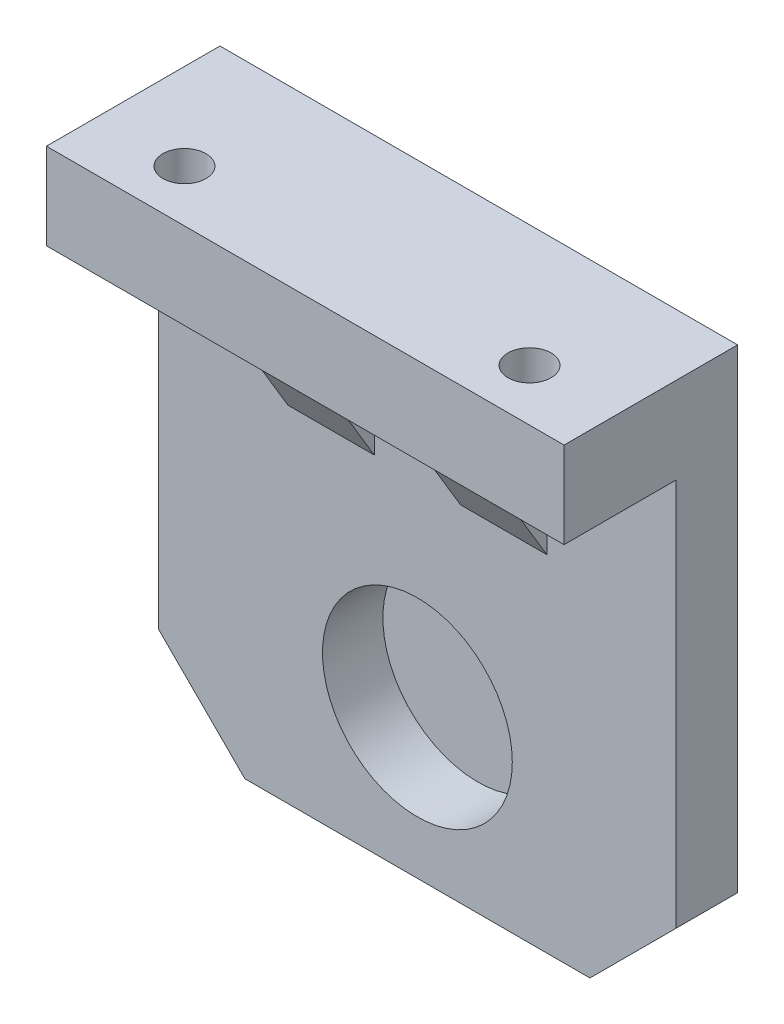
ISO-10303-21;
HEADER;
FILE_DESCRIPTION(('STEP AP214'),'2;1');
FILE_NAME('part.step','',(''),(''),'','','');
FILE_SCHEMA(('AUTOMOTIVE_DESIGN { 1 0 10303 214 1 1 1 1 }'));
ENDSEC;
DATA;
#1=APPLICATION_CONTEXT('core data for automotive mechanical design processes');
#2=APPLICATION_PROTOCOL_DEFINITION('international standard','automotive_design',2000,#1);
#3=PRODUCT_CONTEXT('',#1,'mechanical');
#4=PRODUCT('Part','Part','',(#3));
#5=PRODUCT_RELATED_PRODUCT_CATEGORY('part','',(#4));
#6=PRODUCT_DEFINITION_FORMATION('','',#4);
#7=PRODUCT_DEFINITION_CONTEXT('part definition',#1,'design');
#8=PRODUCT_DEFINITION('design','',#6,#7);
#9=PRODUCT_DEFINITION_SHAPE('','',#8);
#10=(LENGTH_UNIT() NAMED_UNIT(*) SI_UNIT(.MILLI.,.METRE.));
#11=(NAMED_UNIT(*) PLANE_ANGLE_UNIT() SI_UNIT($,.RADIAN.));
#12=(NAMED_UNIT(*) SI_UNIT($,.STERADIAN.) SOLID_ANGLE_UNIT());
#13=UNCERTAINTY_MEASURE_WITH_UNIT(LENGTH_MEASURE(1.E-05),#10,'distance_accuracy_value','');
#14=(GEOMETRIC_REPRESENTATION_CONTEXT(3) GLOBAL_UNCERTAINTY_ASSIGNED_CONTEXT((#13)) GLOBAL_UNIT_ASSIGNED_CONTEXT((#10,
#11,#12)) REPRESENTATION_CONTEXT('',''));
#15=CARTESIAN_POINT('',(0.,0.,0.));
#16=DIRECTION('',(0.,0.,1.));
#17=DIRECTION('',(1.,0.,0.));
#18=AXIS2_PLACEMENT_3D('',#15,#16,#17);
#19=CARTESIAN_POINT('',(29.9999999999989,0.,10.));
#20=DIRECTION('',(1.,0.,0.));
#21=DIRECTION('',(0.,0.,-1.));
#22=AXIS2_PLACEMENT_3D('',#19,#20,#21);
#23=PLANE('',#22);
#24=CARTESIAN_POINT('',(29.9999999999989,15.0999999999986,7.30000000000013));
#25=DIRECTION('',(-1.,0.,0.));
#26=DIRECTION('',(0.,0.,1.));
#27=AXIS2_PLACEMENT_3D('',#24,#25,#26);
#28=CIRCLE('',#27,1.25);
#29=CARTESIAN_POINT('',(29.9999999999989,15.0999999999986,8.55000000000013));
#30=VERTEX_POINT('',#29);
#31=EDGE_CURVE('E343',#30,#30,#28,.T.);
#32=ORIENTED_EDGE('',*,*,#31,.F.);
#33=EDGE_LOOP('',(#32));
#34=FACE_BOUND('',#33,.T.);
#35=CARTESIAN_POINT('',(29.9999999999989,24.5999999999986,7.30000000000014));
#36=DIRECTION('',(-1.,0.,0.));
#37=DIRECTION('',(0.,0.,1.));
#38=AXIS2_PLACEMENT_3D('',#35,#36,#37);
#39=CIRCLE('',#38,1.175);
#40=CARTESIAN_POINT('',(29.9999999999989,24.5999999999986,8.47500000000014));
#41=VERTEX_POINT('',#40);
#42=EDGE_CURVE('E337',#41,#41,#39,.T.);
#43=ORIENTED_EDGE('',*,*,#42,.F.);
#44=EDGE_LOOP('',(#43));
#45=FACE_BOUND('',#44,.T.);
#46=DIRECTION('',(0.,-1.,0.));
#47=VECTOR('',#46,1.);
#48=CARTESIAN_POINT('',(29.9999999999989,0.,2.88675134594813));
#49=LINE('',#48,#47);
#50=CARTESIAN_POINT('',(29.9999999999989,65.,2.88675134594813));
#51=VERTEX_POINT('',#50);
#52=CARTESIAN_POINT('',(29.9999999999989,10.,2.88675134594813));
#53=VERTEX_POINT('',#52);
#54=EDGE_CURVE('E269',#51,#53,#49,.T.);
#55=ORIENTED_EDGE('',*,*,#54,.T.);
#56=DIRECTION('',(0.,0.,1.));
#57=VECTOR('',#56,1.);
#58=CARTESIAN_POINT('',(29.9999999999989,10.,10.));
#59=LINE('',#58,#57);
#60=CARTESIAN_POINT('',(29.9999999999989,10.,10.));
#61=VERTEX_POINT('',#60);
#62=EDGE_CURVE('E11',#53,#61,#59,.T.);
#63=ORIENTED_EDGE('',*,*,#62,.T.);
#64=DIRECTION('',(0.,-1.,0.));
#65=VECTOR('',#64,1.);
#66=CARTESIAN_POINT('',(29.9999999999989,0.,10.));
#67=LINE('',#66,#65);
#68=CARTESIAN_POINT('',(29.9999999999989,55.,10.));
#69=VERTEX_POINT('',#68);
#70=EDGE_CURVE('E241',#69,#61,#67,.T.);
#71=ORIENTED_EDGE('',*,*,#70,.F.);
#72=DIRECTION('',(0.,0.,-1.));
#73=VECTOR('',#72,1.);
#74=CARTESIAN_POINT('',(29.9999999999989,55.,23.));
#75=LINE('',#74,#73);
#76=CARTESIAN_POINT('',(29.9999999999989,55.,23.));
#77=VERTEX_POINT('',#76);
#78=EDGE_CURVE('E233',#77,#69,#75,.T.);
#79=ORIENTED_EDGE('',*,*,#78,.F.);
#80=DIRECTION('',(0.,1.,0.));
#81=VECTOR('',#80,1.);
#82=CARTESIAN_POINT('',(29.9999999999989,65.,23.));
#83=LINE('',#82,#81);
#84=CARTESIAN_POINT('',(29.9999999999989,65.,23.));
#85=VERTEX_POINT('',#84);
#86=EDGE_CURVE('E220',#77,#85,#83,.T.);
#87=ORIENTED_EDGE('',*,*,#86,.T.);
#88=DIRECTION('',(0.,0.,-1.));
#89=VECTOR('',#88,1.);
#90=CARTESIAN_POINT('',(29.9999999999989,65.,10.));
#91=LINE('',#90,#89);
#92=EDGE_CURVE('E249',#85,#51,#91,.T.);
#93=ORIENTED_EDGE('',*,*,#92,.T.);
#94=EDGE_LOOP('',(#55,#63,#71,#79,#87,#93));
#95=FACE_BOUND('',#94,.T.);
#96=ADVANCED_FACE('F33',(#34,#45,#95),#23,.F.);
#97=CARTESIAN_POINT('',(29.9999999999989,0.,10.));
#98=DIRECTION('',(0.,1.,0.));
#99=DIRECTION('',(0.,0.,1.));
#100=AXIS2_PLACEMENT_3D('',#97,#98,#99);
#101=PLANE('',#100);
#102=DIRECTION('',(1.,0.,0.));
#103=VECTOR('',#102,1.);
#104=CARTESIAN_POINT('',(89.9999999999989,0.,2.88675134594813));
#105=LINE('',#104,#103);
#106=CARTESIAN_POINT('',(39.9999999999989,0.,2.88675134594813));
#107=VERTEX_POINT('',#106);
#108=CARTESIAN_POINT('',(79.9999999999988,0.,2.88675134594813));
#109=VERTEX_POINT('',#108);
#110=EDGE_CURVE('E271',#107,#109,#105,.T.);
#111=ORIENTED_EDGE('',*,*,#110,.T.);
#112=DIRECTION('',(0.,0.,1.));
#113=VECTOR('',#112,1.);
#114=CARTESIAN_POINT('',(79.9999999999988,0.,10.));
#115=LINE('',#114,#113);
#116=CARTESIAN_POINT('',(79.9999999999988,0.,10.));
#117=VERTEX_POINT('',#116);
#118=EDGE_CURVE('E290',#109,#117,#115,.T.);
#119=ORIENTED_EDGE('',*,*,#118,.T.);
#120=DIRECTION('',(1.,0.,0.));
#121=VECTOR('',#120,1.);
#122=CARTESIAN_POINT('',(29.9999999999989,0.,10.));
#123=LINE('',#122,#121);
#124=CARTESIAN_POINT('',(39.9999999999989,0.,10.));
#125=VERTEX_POINT('',#124);
#126=EDGE_CURVE('E244',#125,#117,#123,.T.);
#127=ORIENTED_EDGE('',*,*,#126,.F.);
#128=DIRECTION('',(0.,0.,-1.));
#129=VECTOR('',#128,1.);
#130=CARTESIAN_POINT('',(39.9999999999989,0.,10.));
#131=LINE('',#130,#129);
#132=EDGE_CURVE('E287',#125,#107,#131,.T.);
#133=ORIENTED_EDGE('',*,*,#132,.T.);
#134=EDGE_LOOP('',(#111,#119,#127,#133));
#135=FACE_BOUND('',#134,.T.);
#136=ADVANCED_FACE('F360',(#135),#101,.F.);
#137=CARTESIAN_POINT('',(89.9999999999989,0.,10.));
#138=DIRECTION('',(-1.,0.,0.));
#139=DIRECTION('',(0.,0.,1.));
#140=AXIS2_PLACEMENT_3D('',#137,#138,#139);
#141=PLANE('',#140);
#142=DIRECTION('',(0.,1.,0.));
#143=VECTOR('',#142,1.);
#144=CARTESIAN_POINT('',(89.9999999999989,0.,10.));
#145=LINE('',#144,#143);
#146=CARTESIAN_POINT('',(89.9999999999989,9.99999999999999,10.));
#147=VERTEX_POINT('',#146);
#148=CARTESIAN_POINT('',(89.9999999999989,55.,10.));
#149=VERTEX_POINT('',#148);
#150=EDGE_CURVE('E247',#147,#149,#145,.T.);
#151=ORIENTED_EDGE('',*,*,#150,.F.);
#152=DIRECTION('',(0.,0.,-1.));
#153=VECTOR('',#152,1.);
#154=CARTESIAN_POINT('',(89.9999999999989,9.99999999999999,10.));
#155=LINE('',#154,#153);
#156=CARTESIAN_POINT('',(89.9999999999989,10.,2.88675134594813));
#157=VERTEX_POINT('',#156);
#158=EDGE_CURVE('E274',#147,#157,#155,.T.);
#159=ORIENTED_EDGE('',*,*,#158,.T.);
#160=DIRECTION('',(0.,1.,0.));
#161=VECTOR('',#160,1.);
#162=CARTESIAN_POINT('',(89.9999999999989,65.,2.88675134594813));
#163=LINE('',#162,#161);
#164=CARTESIAN_POINT('',(89.9999999999989,65.,2.88675134594813));
#165=VERTEX_POINT('',#164);
#166=EDGE_CURVE('E255',#157,#165,#163,.T.);
#167=ORIENTED_EDGE('',*,*,#166,.T.);
#168=DIRECTION('',(0.,0.,-1.));
#169=VECTOR('',#168,1.);
#170=CARTESIAN_POINT('',(89.9999999999989,65.,10.));
#171=LINE('',#170,#169);
#172=CARTESIAN_POINT('',(89.9999999999989,65.,23.));
#173=VERTEX_POINT('',#172);
#174=EDGE_CURVE('E252',#173,#165,#171,.T.);
#175=ORIENTED_EDGE('',*,*,#174,.F.);
#176=DIRECTION('',(0.,-1.,0.));
#177=VECTOR('',#176,1.);
#178=CARTESIAN_POINT('',(89.9999999999989,65.,23.));
#179=LINE('',#178,#177);
#180=CARTESIAN_POINT('',(89.9999999999989,55.,23.));
#181=VERTEX_POINT('',#180);
#182=EDGE_CURVE('E226',#173,#181,#179,.T.);
#183=ORIENTED_EDGE('',*,*,#182,.T.);
#184=DIRECTION('',(0.,0.,-1.));
#185=VECTOR('',#184,1.);
#186=CARTESIAN_POINT('',(89.9999999999989,55.,23.));
#187=LINE('',#186,#185);
#188=EDGE_CURVE('E232',#181,#149,#187,.T.);
#189=ORIENTED_EDGE('',*,*,#188,.T.);
#190=EDGE_LOOP('',(#151,#159,#167,#175,#183,#189));
#191=FACE_BOUND('',#190,.T.);
#192=ADVANCED_FACE('F304',(#191),#141,.F.);
#193=CARTESIAN_POINT('',(29.9999999999989,65.,10.));
#194=DIRECTION('',(0.,-1.,0.));
#195=DIRECTION('',(0.,0.,-1.));
#196=AXIS2_PLACEMENT_3D('',#193,#194,#195);
#197=PLANE('',#196);
#198=DIRECTION('',(1.,0.,0.));
#199=VECTOR('',#198,1.);
#200=CARTESIAN_POINT('',(29.9999999999989,65.,23.));
#201=LINE('',#200,#199);
#202=EDGE_CURVE('E223',#85,#173,#201,.T.);
#203=ORIENTED_EDGE('',*,*,#202,.T.);
#204=ORIENTED_EDGE('',*,*,#174,.T.);
#205=DIRECTION('',(-1.,0.,0.));
#206=VECTOR('',#205,1.);
#207=CARTESIAN_POINT('',(29.9999999999989,65.,2.88675134594813));
#208=LINE('',#207,#206);
#209=EDGE_CURVE('E267',#165,#51,#208,.T.);
#210=ORIENTED_EDGE('',*,*,#209,.T.);
#211=ORIENTED_EDGE('',*,*,#92,.F.);
#212=EDGE_LOOP('',(#203,#204,#210,#211));
#213=FACE_BOUND('',#212,.T.);
#214=CARTESIAN_POINT('',(40.,65.,17.));
#215=DIRECTION('',(0.,-1.,0.));
#216=DIRECTION('',(-1.,0.,0.));
#217=AXIS2_PLACEMENT_3D('',#214,#215,#216);
#218=CIRCLE('',#217,2.50000000000001);
#219=CARTESIAN_POINT('',(37.5,65.,17.));
#220=VERTEX_POINT('',#219);
#221=EDGE_CURVE('E202',#220,#220,#218,.T.);
#222=ORIENTED_EDGE('',*,*,#221,.T.);
#223=EDGE_LOOP('',(#222));
#224=FACE_BOUND('',#223,.T.);
#225=CARTESIAN_POINT('',(80.,65.,17.));
#226=DIRECTION('',(0.,-1.,0.));
#227=DIRECTION('',(1.,0.,0.));
#228=AXIS2_PLACEMENT_3D('',#225,#226,#227);
#229=CIRCLE('',#228,2.50000000000001);
#230=CARTESIAN_POINT('',(82.5,65.,17.));
#231=VERTEX_POINT('',#230);
#232=EDGE_CURVE('E208',#231,#231,#229,.T.);
#233=ORIENTED_EDGE('',*,*,#232,.T.);
#234=EDGE_LOOP('',(#233));
#235=FACE_BOUND('',#234,.T.);
#236=ADVANCED_FACE('F325',(#213,#224,#235),#197,.F.);
#237=CARTESIAN_POINT('',(0.,0.,10.));
#238=DIRECTION('',(0.,0.,-1.));
#239=DIRECTION('',(-1.,0.,0.));
#240=AXIS2_PLACEMENT_3D('',#237,#238,#239);
#241=PLANE('',#240);
#242=CARTESIAN_POINT('',(59.9999999999989,17.17,10.));
#243=DIRECTION('',(0.,0.,1.));
#244=DIRECTION('',(1.,0.,0.));
#245=AXIS2_PLACEMENT_3D('',#242,#243,#244);
#246=CIRCLE('',#245,11.);
#247=CARTESIAN_POINT('',(70.9999999999989,17.17,10.));
#248=VERTEX_POINT('',#247);
#249=EDGE_CURVE('E211',#248,#248,#246,.T.);
#250=ORIENTED_EDGE('',*,*,#249,.F.);
#251=EDGE_LOOP('',(#250));
#252=FACE_BOUND('',#251,.T.);
#253=ORIENTED_EDGE('',*,*,#126,.T.);
#254=DIRECTION('',(-0.707106781186549,-0.707106781186546,0.));
#255=VECTOR('',#254,1.);
#256=CARTESIAN_POINT('',(89.9999999999989,9.99999999999999,10.));
#257=LINE('',#256,#255);
#258=EDGE_CURVE('E294',#117,#147,#257,.F.);
#259=ORIENTED_EDGE('',*,*,#258,.T.);
#260=ORIENTED_EDGE('',*,*,#150,.T.);
#261=DIRECTION('',(-1.,0.,0.));
#262=VECTOR('',#261,1.);
#263=CARTESIAN_POINT('',(0.,55.,10.));
#264=LINE('',#263,#262);
#265=CARTESIAN_POINT('',(74.9999999999989,55.,10.));
#266=VERTEX_POINT('',#265);
#267=EDGE_CURVE('E239',#149,#266,#264,.T.);
#268=ORIENTED_EDGE('',*,*,#267,.T.);
#269=DIRECTION('',(0.,1.,0.));
#270=VECTOR('',#269,1.);
#271=CARTESIAN_POINT('',(74.9999999999989,0.,10.));
#272=LINE('',#271,#270);
#273=CARTESIAN_POINT('',(74.9999999999989,40.,10.));
#274=VERTEX_POINT('',#273);
#275=EDGE_CURVE('E151',#274,#266,#272,.T.);
#276=ORIENTED_EDGE('',*,*,#275,.F.);
#277=DIRECTION('',(1.,0.,0.));
#278=VECTOR('',#277,1.);
#279=CARTESIAN_POINT('',(0.,40.,10.));
#280=LINE('',#279,#278);
#281=CARTESIAN_POINT('',(64.9999999999989,40.,10.));
#282=VERTEX_POINT('',#281);
#283=EDGE_CURVE('E164',#274,#282,#280,.F.);
#284=ORIENTED_EDGE('',*,*,#283,.T.);
#285=DIRECTION('',(0.,1.,0.));
#286=VECTOR('',#285,1.);
#287=CARTESIAN_POINT('',(64.9999999999989,0.,10.));
#288=LINE('',#287,#286);
#289=CARTESIAN_POINT('',(64.9999999999989,55.,10.));
#290=VERTEX_POINT('',#289);
#291=EDGE_CURVE('E172',#282,#290,#288,.T.);
#292=ORIENTED_EDGE('',*,*,#291,.T.);
#293=CARTESIAN_POINT('',(54.9999999999989,55.,10.));
#294=VERTEX_POINT('',#293);
#295=EDGE_CURVE('E242',#290,#294,#264,.T.);
#296=ORIENTED_EDGE('',*,*,#295,.T.);
#297=DIRECTION('',(0.,-1.,0.));
#298=VECTOR('',#297,1.);
#299=CARTESIAN_POINT('',(54.9999999999989,0.,10.));
#300=LINE('',#299,#298);
#301=CARTESIAN_POINT('',(54.9999999999989,40.,10.));
#302=VERTEX_POINT('',#301);
#303=EDGE_CURVE('E192',#294,#302,#300,.T.);
#304=ORIENTED_EDGE('',*,*,#303,.T.);
#305=DIRECTION('',(-1.,0.,0.));
#306=VECTOR('',#305,1.);
#307=CARTESIAN_POINT('',(0.,40.,10.));
#308=LINE('',#307,#306);
#309=CARTESIAN_POINT('',(44.9999999999989,40.,10.));
#310=VERTEX_POINT('',#309);
#311=EDGE_CURVE('E198',#302,#310,#308,.T.);
#312=ORIENTED_EDGE('',*,*,#311,.T.);
#313=DIRECTION('',(0.,-1.,0.));
#314=VECTOR('',#313,1.);
#315=CARTESIAN_POINT('',(44.9999999999989,0.,10.));
#316=LINE('',#315,#314);
#317=CARTESIAN_POINT('',(44.9999999999989,55.,10.));
#318=VERTEX_POINT('',#317);
#319=EDGE_CURVE('E188',#318,#310,#316,.T.);
#320=ORIENTED_EDGE('',*,*,#319,.F.);
#321=EDGE_CURVE('E236',#318,#69,#264,.T.);
#322=ORIENTED_EDGE('',*,*,#321,.T.);
#323=ORIENTED_EDGE('',*,*,#70,.T.);
#324=DIRECTION('',(-0.707106781186546,0.707106781186549,0.));
#325=VECTOR('',#324,1.);
#326=CARTESIAN_POINT('',(39.9999999999989,0.,10.));
#327=LINE('',#326,#325);
#328=EDGE_CURVE('E292',#61,#125,#327,.F.);
#329=ORIENTED_EDGE('',*,*,#328,.T.);
#330=EDGE_LOOP('',(#253,#259,#260,#268,#276,#284,#292,#296,#304,#312,#320,#322,#323,#329));
#331=FACE_BOUND('',#330,.T.);
#332=ADVANCED_FACE('F298',(#252,#331),#241,.F.);
#333=CARTESIAN_POINT('',(0.,0.,0.));
#334=DIRECTION('',(0.,0.,-1.));
#335=DIRECTION('',(-1.,0.,0.));
#336=AXIS2_PLACEMENT_3D('',#333,#334,#335);
#337=PLANE('',#336);
#338=DIRECTION('',(1.,0.,0.));
#339=VECTOR('',#338,1.);
#340=CARTESIAN_POINT('',(89.9999999999989,60.,0.));
#341=LINE('',#340,#339);
#342=CARTESIAN_POINT('',(34.9999999999989,60.,0.));
#343=VERTEX_POINT('',#342);
#344=CARTESIAN_POINT('',(84.9999999999988,60.,0.));
#345=VERTEX_POINT('',#344);
#346=EDGE_CURVE('E262',#343,#345,#341,.T.);
#347=ORIENTED_EDGE('',*,*,#346,.T.);
#348=DIRECTION('',(0.,-1.,0.));
#349=VECTOR('',#348,1.);
#350=CARTESIAN_POINT('',(84.9999999999988,0.,0.));
#351=LINE('',#350,#349);
#352=CARTESIAN_POINT('',(84.9999999999988,5.00000000000005,0.));
#353=VERTEX_POINT('',#352);
#354=EDGE_CURVE('E264',#345,#353,#351,.T.);
#355=ORIENTED_EDGE('',*,*,#354,.T.);
#356=DIRECTION('',(-1.,0.,0.));
#357=VECTOR('',#356,1.);
#358=CARTESIAN_POINT('',(29.9999999999989,5.00000000000005,0.));
#359=LINE('',#358,#357);
#360=CARTESIAN_POINT('',(34.9999999999989,5.00000000000005,0.));
#361=VERTEX_POINT('',#360);
#362=EDGE_CURVE('E257',#353,#361,#359,.T.);
#363=ORIENTED_EDGE('',*,*,#362,.T.);
#364=DIRECTION('',(0.,1.,0.));
#365=VECTOR('',#364,1.);
#366=CARTESIAN_POINT('',(34.9999999999989,65.,0.));
#367=LINE('',#366,#365);
#368=EDGE_CURVE('E260',#361,#343,#367,.T.);
#369=ORIENTED_EDGE('',*,*,#368,.T.);
#370=EDGE_LOOP('',(#347,#355,#363,#369));
#371=FACE_BOUND('',#370,.T.);
#372=ADVANCED_FACE('F317',(#371),#337,.T.);
#373=CARTESIAN_POINT('',(29.9999999999989,55.,23.));
#374=DIRECTION('',(0.,-1.,0.));
#375=DIRECTION('',(1.,0.,0.));
#376=AXIS2_PLACEMENT_3D('',#373,#374,#375);
#377=PLANE('',#376);
#378=DIRECTION('',(0.,0.,-1.));
#379=VECTOR('',#378,1.);
#380=CARTESIAN_POINT('',(64.9999999999989,55.,23.));
#381=LINE('',#380,#379);
#382=CARTESIAN_POINT('',(64.9999999999989,55.,19.));
#383=VERTEX_POINT('',#382);
#384=EDGE_CURVE('E171',#383,#290,#381,.T.);
#385=ORIENTED_EDGE('',*,*,#384,.F.);
#386=DIRECTION('',(1.,0.,0.));
#387=VECTOR('',#386,1.);
#388=CARTESIAN_POINT('',(29.9999999999989,55.,19.));
#389=LINE('',#388,#387);
#390=CARTESIAN_POINT('',(74.9999999999989,55.,19.));
#391=VERTEX_POINT('',#390);
#392=EDGE_CURVE('E161',#391,#383,#389,.F.);
#393=ORIENTED_EDGE('',*,*,#392,.F.);
#394=DIRECTION('',(0.,0.,-1.));
#395=VECTOR('',#394,1.);
#396=CARTESIAN_POINT('',(74.9999999999989,55.,23.));
#397=LINE('',#396,#395);
#398=EDGE_CURVE('E146',#391,#266,#397,.T.);
#399=ORIENTED_EDGE('',*,*,#398,.T.);
#400=ORIENTED_EDGE('',*,*,#267,.F.);
#401=ORIENTED_EDGE('',*,*,#188,.F.);
#402=DIRECTION('',(-1.,0.,0.));
#403=VECTOR('',#402,1.);
#404=CARTESIAN_POINT('',(29.9999999999989,55.,23.));
#405=LINE('',#404,#403);
#406=EDGE_CURVE('E229',#181,#77,#405,.T.);
#407=ORIENTED_EDGE('',*,*,#406,.T.);
#408=ORIENTED_EDGE('',*,*,#78,.T.);
#409=ORIENTED_EDGE('',*,*,#321,.F.);
#410=DIRECTION('',(0.,0.,1.));
#411=VECTOR('',#410,1.);
#412=CARTESIAN_POINT('',(44.9999999999989,55.,23.));
#413=LINE('',#412,#411);
#414=CARTESIAN_POINT('',(44.9999999999989,55.,19.));
#415=VERTEX_POINT('',#414);
#416=EDGE_CURVE('E183',#318,#415,#413,.T.);
#417=ORIENTED_EDGE('',*,*,#416,.T.);
#418=DIRECTION('',(-1.,0.,0.));
#419=VECTOR('',#418,1.);
#420=CARTESIAN_POINT('',(29.9999999999989,55.,19.));
#421=LINE('',#420,#419);
#422=CARTESIAN_POINT('',(54.9999999999989,55.,19.));
#423=VERTEX_POINT('',#422);
#424=EDGE_CURVE('E195',#423,#415,#421,.T.);
#425=ORIENTED_EDGE('',*,*,#424,.F.);
#426=DIRECTION('',(0.,0.,1.));
#427=VECTOR('',#426,1.);
#428=CARTESIAN_POINT('',(54.9999999999989,55.,23.));
#429=LINE('',#428,#427);
#430=EDGE_CURVE('E190',#294,#423,#429,.T.);
#431=ORIENTED_EDGE('',*,*,#430,.F.);
#432=ORIENTED_EDGE('',*,*,#295,.F.);
#433=EDGE_LOOP('',(#385,#393,#399,#400,#401,#407,#408,#409,#417,#425,#431,#432));
#434=FACE_BOUND('',#433,.T.);
#435=CARTESIAN_POINT('',(40.,55.,17.));
#436=DIRECTION('',(0.,-1.,0.));
#437=DIRECTION('',(-1.,0.,0.));
#438=AXIS2_PLACEMENT_3D('',#435,#436,#437);
#439=CIRCLE('',#438,2.50000000000001);
#440=CARTESIAN_POINT('',(37.5,55.,17.));
#441=VERTEX_POINT('',#440);
#442=EDGE_CURVE('E201',#441,#441,#439,.T.);
#443=ORIENTED_EDGE('',*,*,#442,.F.);
#444=EDGE_LOOP('',(#443));
#445=FACE_BOUND('',#444,.T.);
#446=CARTESIAN_POINT('',(80.,55.,17.));
#447=DIRECTION('',(0.,-1.,0.));
#448=DIRECTION('',(1.,0.,0.));
#449=AXIS2_PLACEMENT_3D('',#446,#447,#448);
#450=CIRCLE('',#449,2.50000000000001);
#451=CARTESIAN_POINT('',(82.5,55.,17.));
#452=VERTEX_POINT('',#451);
#453=EDGE_CURVE('E205',#452,#452,#450,.T.);
#454=ORIENTED_EDGE('',*,*,#453,.F.);
#455=EDGE_LOOP('',(#454));
#456=FACE_BOUND('',#455,.T.);
#457=ADVANCED_FACE('F168',(#434,#445,#456),#377,.T.);
#458=CARTESIAN_POINT('',(0.,0.,23.));
#459=DIRECTION('',(0.,0.,1.));
#460=DIRECTION('',(1.,0.,0.));
#461=AXIS2_PLACEMENT_3D('',#458,#459,#460);
#462=PLANE('',#461);
#463=ORIENTED_EDGE('',*,*,#182,.F.);
#464=ORIENTED_EDGE('',*,*,#202,.F.);
#465=ORIENTED_EDGE('',*,*,#86,.F.);
#466=ORIENTED_EDGE('',*,*,#406,.F.);
#467=EDGE_LOOP('',(#463,#464,#465,#466));
#468=FACE_BOUND('',#467,.T.);
#469=ADVANCED_FACE('F331',(#468),#462,.T.);
#470=CARTESIAN_POINT('',(29.9999999999989,0.,2.88675134594813));
#471=DIRECTION('',(-0.499999999999997,0.,-0.86602540378444));
#472=DIRECTION('',(0.,1.,0.));
#473=AXIS2_PLACEMENT_3D('',#470,#471,#472);
#474=PLANE('',#473);
#475=ORIENTED_EDGE('',*,*,#368,.F.);
#476=DIRECTION('',(0.654653670707977,-0.65465367070798,-0.377964473009224));
#477=VECTOR('',#476,1.);
#478=CARTESIAN_POINT('',(34.2857142857132,5.7142857142857,0.412393049421171));
#479=LINE('',#478,#477);
#480=EDGE_CURVE('E41',#361,#53,#479,.F.);
#481=ORIENTED_EDGE('',*,*,#480,.T.);
#482=ORIENTED_EDGE('',*,*,#54,.F.);
#483=DIRECTION('',(0.654653670707978,-0.654653670707978,-0.377964473009225));
#484=VECTOR('',#483,1.);
#485=CARTESIAN_POINT('',(57.8571428571418,37.1428571428571,-13.1965775814771));
#486=LINE('',#485,#484);
#487=EDGE_CURVE('E224',#343,#51,#486,.F.);
#488=ORIENTED_EDGE('',*,*,#487,.F.);
#489=EDGE_LOOP('',(#475,#481,#482,#488));
#490=FACE_BOUND('',#489,.T.);
#491=ADVANCED_FACE('F383',(#490),#474,.T.);
#492=CARTESIAN_POINT('',(29.9999999999989,0.,2.88675134594813));
#493=DIRECTION('',(0.,-0.499999999999997,-0.86602540378444));
#494=DIRECTION('',(-1.,0.,0.));
#495=AXIS2_PLACEMENT_3D('',#492,#493,#494);
#496=PLANE('',#495);
#497=ORIENTED_EDGE('',*,*,#362,.F.);
#498=DIRECTION('',(0.65465367070798,0.654653670707977,-0.377964473009224));
#499=VECTOR('',#498,1.);
#500=CARTESIAN_POINT('',(58.5714285714273,-21.4285714285715,15.2585428285829));
#501=LINE('',#500,#499);
#502=EDGE_CURVE('E285',#353,#109,#501,.F.);
#503=ORIENTED_EDGE('',*,*,#502,.T.);
#504=ORIENTED_EDGE('',*,*,#110,.F.);
#505=DIRECTION('',(0.654653670707976,-0.654653670707979,0.377964473009225));
#506=VECTOR('',#505,1.);
#507=CARTESIAN_POINT('',(35.7142857142846,4.28571428571428,0.412393049421185));
#508=LINE('',#507,#506);
#509=EDGE_CURVE('E283',#107,#361,#508,.F.);
#510=ORIENTED_EDGE('',*,*,#509,.T.);
#511=EDGE_LOOP('',(#497,#503,#504,#510));
#512=FACE_BOUND('',#511,.T.);
#513=ADVANCED_FACE('F314',(#512),#496,.T.);
#514=CARTESIAN_POINT('',(29.9999999999989,65.,2.88675134594813));
#515=DIRECTION('',(0.,0.499999999999997,-0.86602540378444));
#516=DIRECTION('',(1.,0.,0.));
#517=AXIS2_PLACEMENT_3D('',#514,#515,#516);
#518=PLANE('',#517);
#519=ORIENTED_EDGE('',*,*,#487,.T.);
#520=ORIENTED_EDGE('',*,*,#209,.F.);
#521=DIRECTION('',(-0.654653670707978,-0.654653670707978,-0.377964473009225));
#522=VECTOR('',#521,1.);
#523=CARTESIAN_POINT('',(64.2857142857131,39.2857142857142,-11.9593984332136));
#524=LINE('',#523,#522);
#525=EDGE_CURVE('E217',#345,#165,#524,.F.);
#526=ORIENTED_EDGE('',*,*,#525,.F.);
#527=ORIENTED_EDGE('',*,*,#346,.F.);
#528=EDGE_LOOP('',(#519,#520,#526,#527));
#529=FACE_BOUND('',#528,.T.);
#530=ADVANCED_FACE('F321',(#529),#518,.T.);
#531=CARTESIAN_POINT('',(89.9999999999989,0.,2.88675134594813));
#532=DIRECTION('',(0.499999999999997,0.,-0.86602540378444));
#533=DIRECTION('',(0.,-1.,0.));
#534=AXIS2_PLACEMENT_3D('',#531,#532,#533);
#535=PLANE('',#534);
#536=ORIENTED_EDGE('',*,*,#166,.F.);
#537=DIRECTION('',(0.654653670707979,0.654653670707976,0.377964473009225));
#538=VECTOR('',#537,1.);
#539=CARTESIAN_POINT('',(85.7142857142846,5.71428571428572,0.412393049421182));
#540=LINE('',#539,#538);
#541=EDGE_CURVE('E281',#157,#353,#540,.F.);
#542=ORIENTED_EDGE('',*,*,#541,.T.);
#543=ORIENTED_EDGE('',*,*,#354,.F.);
#544=ORIENTED_EDGE('',*,*,#525,.T.);
#545=EDGE_LOOP('',(#536,#542,#543,#544));
#546=FACE_BOUND('',#545,.T.);
#547=ADVANCED_FACE('F311',(#546),#535,.T.);
#548=CARTESIAN_POINT('',(59.9999999999989,17.17,3.));
#549=DIRECTION('',(0.,0.,1.));
#550=DIRECTION('',(1.,0.,0.));
#551=AXIS2_PLACEMENT_3D('',#548,#549,#550);
#552=CYLINDRICAL_SURFACE('',#551,11.);
#553=CARTESIAN_POINT('',(59.9999999999989,17.17,3.));
#554=DIRECTION('',(0.,0.,1.));
#555=DIRECTION('',(1.,0.,0.));
#556=AXIS2_PLACEMENT_3D('',#553,#554,#555);
#557=CIRCLE('',#556,11.);
#558=CARTESIAN_POINT('',(70.9999999999989,17.17,3.));
#559=VERTEX_POINT('',#558);
#560=EDGE_CURVE('E214',#559,#559,#557,.T.);
#561=ORIENTED_EDGE('',*,*,#560,.F.);
#562=EDGE_LOOP('',(#561));
#563=FACE_BOUND('',#562,.T.);
#564=ORIENTED_EDGE('',*,*,#249,.T.);
#565=EDGE_LOOP('',(#564));
#566=FACE_BOUND('',#565,.T.);
#567=ADVANCED_FACE('F378',(#563,#566),#552,.F.);
#568=CARTESIAN_POINT('',(59.9999999999989,17.17,3.));
#569=DIRECTION('',(0.,0.,1.));
#570=DIRECTION('',(1.,0.,0.));
#571=AXIS2_PLACEMENT_3D('',#568,#569,#570);
#572=PLANE('',#571);
#573=ORIENTED_EDGE('',*,*,#560,.T.);
#574=EDGE_LOOP('',(#573));
#575=FACE_BOUND('',#574,.T.);
#576=ADVANCED_FACE('F421',(#575),#572,.T.);
#577=CARTESIAN_POINT('',(80.,65.,17.));
#578=DIRECTION('',(0.,-1.,0.));
#579=DIRECTION('',(1.,0.,0.));
#580=AXIS2_PLACEMENT_3D('',#577,#578,#579);
#581=CYLINDRICAL_SURFACE('',#580,2.50000000000001);
#582=ORIENTED_EDGE('',*,*,#232,.F.);
#583=EDGE_LOOP('',(#582));
#584=FACE_BOUND('',#583,.T.);
#585=ORIENTED_EDGE('',*,*,#453,.T.);
#586=EDGE_LOOP('',(#585));
#587=FACE_BOUND('',#586,.T.);
#588=ADVANCED_FACE('F417',(#584,#587),#581,.F.);
#589=CARTESIAN_POINT('',(40.,65.,17.));
#590=DIRECTION('',(0.,-1.,0.));
#591=DIRECTION('',(1.,0.,0.));
#592=AXIS2_PLACEMENT_3D('',#589,#590,#591);
#593=CYLINDRICAL_SURFACE('',#592,2.50000000000001);
#594=ORIENTED_EDGE('',*,*,#221,.F.);
#595=EDGE_LOOP('',(#594));
#596=FACE_BOUND('',#595,.T.);
#597=ORIENTED_EDGE('',*,*,#442,.T.);
#598=EDGE_LOOP('',(#597));
#599=FACE_BOUND('',#598,.T.);
#600=ADVANCED_FACE('F413',(#596,#599),#593,.F.);
#601=CARTESIAN_POINT('',(49.9999999999989,55.,19.));
#602=DIRECTION('',(0.,-0.514495755427527,0.857492925712544));
#603=DIRECTION('',(0.,-0.857492925712544,-0.514495755427527));
#604=AXIS2_PLACEMENT_3D('',#601,#602,#603);
#605=PLANE('',#604);
#606=ORIENTED_EDGE('',*,*,#311,.F.);
#607=DIRECTION('',(0.,-0.857492925712544,-0.514495755427527));
#608=VECTOR('',#607,1.);
#609=CARTESIAN_POINT('',(54.9999999999989,55.,19.));
#610=LINE('',#609,#608);
#611=EDGE_CURVE('E180',#423,#302,#610,.T.);
#612=ORIENTED_EDGE('',*,*,#611,.F.);
#613=ORIENTED_EDGE('',*,*,#424,.T.);
#614=DIRECTION('',(0.,-0.857492925712544,-0.514495755427527));
#615=VECTOR('',#614,1.);
#616=CARTESIAN_POINT('',(44.9999999999989,55.,19.));
#617=LINE('',#616,#615);
#618=EDGE_CURVE('E174',#415,#310,#617,.T.);
#619=ORIENTED_EDGE('',*,*,#618,.T.);
#620=EDGE_LOOP('',(#606,#612,#613,#619));
#621=FACE_BOUND('',#620,.T.);
#622=ADVANCED_FACE('F406',(#621),#605,.T.);
#623=CARTESIAN_POINT('',(54.9999999999989,32.5,11.5));
#624=DIRECTION('',(1.,0.,0.));
#625=DIRECTION('',(0.,0.,-1.));
#626=AXIS2_PLACEMENT_3D('',#623,#624,#625);
#627=PLANE('',#626);
#628=ORIENTED_EDGE('',*,*,#303,.F.);
#629=ORIENTED_EDGE('',*,*,#430,.T.);
#630=ORIENTED_EDGE('',*,*,#611,.T.);
#631=EDGE_LOOP('',(#628,#629,#630));
#632=FACE_BOUND('',#631,.T.);
#633=ADVANCED_FACE('F403',(#632),#627,.T.);
#634=CARTESIAN_POINT('',(44.9999999999989,32.5,11.5));
#635=DIRECTION('',(1.,0.,0.));
#636=DIRECTION('',(0.,0.,-1.));
#637=AXIS2_PLACEMENT_3D('',#634,#635,#636);
#638=PLANE('',#637);
#639=ORIENTED_EDGE('',*,*,#416,.F.);
#640=ORIENTED_EDGE('',*,*,#319,.T.);
#641=ORIENTED_EDGE('',*,*,#618,.F.);
#642=EDGE_LOOP('',(#639,#640,#641));
#643=FACE_BOUND('',#642,.T.);
#644=ADVANCED_FACE('F402',(#643),#638,.F.);
#645=CARTESIAN_POINT('',(69.9999999999989,55.,19.));
#646=DIRECTION('',(0.,0.514495755427527,-0.857492925712544));
#647=DIRECTION('',(0.,-0.857492925712544,-0.514495755427527));
#648=AXIS2_PLACEMENT_3D('',#645,#646,#647);
#649=PLANE('',#648);
#650=ORIENTED_EDGE('',*,*,#283,.F.);
#651=DIRECTION('',(0.,-0.857492925712544,-0.514495755427527));
#652=VECTOR('',#651,1.);
#653=CARTESIAN_POINT('',(74.9999999999989,55.,19.));
#654=LINE('',#653,#652);
#655=EDGE_CURVE('E149',#391,#274,#654,.T.);
#656=ORIENTED_EDGE('',*,*,#655,.F.);
#657=ORIENTED_EDGE('',*,*,#392,.T.);
#658=DIRECTION('',(0.,-0.857492925712544,-0.514495755427527));
#659=VECTOR('',#658,1.);
#660=CARTESIAN_POINT('',(64.9999999999989,55.,19.));
#661=LINE('',#660,#659);
#662=EDGE_CURVE('E156',#383,#282,#661,.T.);
#663=ORIENTED_EDGE('',*,*,#662,.T.);
#664=EDGE_LOOP('',(#650,#656,#657,#663));
#665=FACE_BOUND('',#664,.T.);
#666=ADVANCED_FACE('F159',(#665),#649,.F.);
#667=CARTESIAN_POINT('',(64.9999999999989,32.5,11.5));
#668=DIRECTION('',(-1.,0.,0.));
#669=DIRECTION('',(0.,0.,1.));
#670=AXIS2_PLACEMENT_3D('',#667,#668,#669);
#671=PLANE('',#670);
#672=ORIENTED_EDGE('',*,*,#291,.F.);
#673=ORIENTED_EDGE('',*,*,#662,.F.);
#674=ORIENTED_EDGE('',*,*,#384,.T.);
#675=EDGE_LOOP('',(#672,#673,#674));
#676=FACE_BOUND('',#675,.T.);
#677=ADVANCED_FACE('F391',(#676),#671,.T.);
#678=CARTESIAN_POINT('',(74.9999999999989,32.5,11.5));
#679=DIRECTION('',(-1.,0.,0.));
#680=DIRECTION('',(0.,0.,1.));
#681=AXIS2_PLACEMENT_3D('',#678,#679,#680);
#682=PLANE('',#681);
#683=ORIENTED_EDGE('',*,*,#655,.T.);
#684=ORIENTED_EDGE('',*,*,#275,.T.);
#685=ORIENTED_EDGE('',*,*,#398,.F.);
#686=EDGE_LOOP('',(#683,#684,#685));
#687=FACE_BOUND('',#686,.T.);
#688=ADVANCED_FACE('F148',(#687),#682,.F.);
#689=CARTESIAN_POINT('',(89.9999999999989,9.99999999999999,10.));
#690=DIRECTION('',(-0.707106781186546,0.707106781186549,0.));
#691=DIRECTION('',(0.,0.,-1.));
#692=AXIS2_PLACEMENT_3D('',#689,#690,#691);
#693=PLANE('',#692);
#694=ORIENTED_EDGE('',*,*,#258,.F.);
#695=ORIENTED_EDGE('',*,*,#118,.F.);
#696=ORIENTED_EDGE('',*,*,#502,.F.);
#697=ORIENTED_EDGE('',*,*,#541,.F.);
#698=ORIENTED_EDGE('',*,*,#158,.F.);
#699=EDGE_LOOP('',(#694,#695,#696,#697,#698));
#700=FACE_BOUND('',#699,.T.);
#701=ADVANCED_FACE('F306',(#700),#693,.F.);
#702=CARTESIAN_POINT('',(39.9999999999989,0.,10.));
#703=DIRECTION('',(0.707106781186549,0.707106781186546,0.));
#704=DIRECTION('',(0.,0.,-1.));
#705=AXIS2_PLACEMENT_3D('',#702,#703,#704);
#706=PLANE('',#705);
#707=ORIENTED_EDGE('',*,*,#328,.F.);
#708=ORIENTED_EDGE('',*,*,#62,.F.);
#709=ORIENTED_EDGE('',*,*,#480,.F.);
#710=ORIENTED_EDGE('',*,*,#509,.F.);
#711=ORIENTED_EDGE('',*,*,#132,.F.);
#712=EDGE_LOOP('',(#707,#708,#709,#710,#711));
#713=FACE_BOUND('',#712,.T.);
#714=ADVANCED_FACE('F35',(#713),#706,.F.);
#715=CARTESIAN_POINT('',(34.9999999999989,24.5999999999986,7.30000000000014));
#716=DIRECTION('',(-1.,0.,0.));
#717=DIRECTION('',(0.,0.,1.));
#718=AXIS2_PLACEMENT_3D('',#715,#716,#717);
#719=CYLINDRICAL_SURFACE('',#718,1.175);
#720=CARTESIAN_POINT('',(34.9999999999989,24.5999999999986,7.30000000000014));
#721=DIRECTION('',(-1.,0.,0.));
#722=DIRECTION('',(0.,0.,1.));
#723=AXIS2_PLACEMENT_3D('',#720,#721,#722);
#724=CIRCLE('',#723,1.175);
#725=CARTESIAN_POINT('',(34.9999999999989,24.5999999999986,8.47500000000014));
#726=VERTEX_POINT('',#725);
#727=EDGE_CURVE('E165',#726,#726,#724,.T.);
#728=ORIENTED_EDGE('',*,*,#727,.F.);
#729=EDGE_LOOP('',(#728));
#730=FACE_BOUND('',#729,.T.);
#731=ORIENTED_EDGE('',*,*,#42,.T.);
#732=EDGE_LOOP('',(#731));
#733=FACE_BOUND('',#732,.T.);
#734=ADVANCED_FACE('F390',(#730,#733),#719,.F.);
#735=CARTESIAN_POINT('',(34.9999999999989,24.5999999999986,7.30000000000014));
#736=DIRECTION('',(-1.,0.,0.));
#737=DIRECTION('',(0.,0.,1.));
#738=AXIS2_PLACEMENT_3D('',#735,#736,#737);
#739=PLANE('',#738);
#740=ORIENTED_EDGE('',*,*,#727,.T.);
#741=EDGE_LOOP('',(#740));
#742=FACE_BOUND('',#741,.T.);
#743=ADVANCED_FACE('F354',(#742),#739,.T.);
#744=CARTESIAN_POINT('',(34.9999999999989,15.0999999999986,7.30000000000013));
#745=DIRECTION('',(-1.,0.,0.));
#746=DIRECTION('',(0.,0.,1.));
#747=AXIS2_PLACEMENT_3D('',#744,#745,#746);
#748=CYLINDRICAL_SURFACE('',#747,1.25);
#749=CARTESIAN_POINT('',(34.9999999999989,15.0999999999986,7.30000000000013));
#750=DIRECTION('',(-1.,0.,0.));
#751=DIRECTION('',(0.,0.,1.));
#752=AXIS2_PLACEMENT_3D('',#749,#750,#751);
#753=CIRCLE('',#752,1.25);
#754=CARTESIAN_POINT('',(34.9999999999989,15.0999999999986,8.55000000000013));
#755=VERTEX_POINT('',#754);
#756=EDGE_CURVE('E340',#755,#755,#753,.T.);
#757=ORIENTED_EDGE('',*,*,#756,.F.);
#758=EDGE_LOOP('',(#757));
#759=FACE_BOUND('',#758,.T.);
#760=ORIENTED_EDGE('',*,*,#31,.T.);
#761=EDGE_LOOP('',(#760));
#762=FACE_BOUND('',#761,.T.);
#763=ADVANCED_FACE('F351',(#759,#762),#748,.F.);
#764=CARTESIAN_POINT('',(34.9999999999989,15.0999999999986,7.30000000000013));
#765=DIRECTION('',(-1.,0.,0.));
#766=DIRECTION('',(0.,0.,1.));
#767=AXIS2_PLACEMENT_3D('',#764,#765,#766);
#768=PLANE('',#767);
#769=ORIENTED_EDGE('',*,*,#756,.T.);
#770=EDGE_LOOP('',(#769));
#771=FACE_BOUND('',#770,.T.);
#772=ADVANCED_FACE('F349',(#771),#768,.T.);
#773=CLOSED_SHELL('',(#96,#136,#192,#236,#332,#372,#457,#469,#491,#513,#530,#547,#567,#576,#588,
#600,#622,#633,#644,#666,#677,#688,#701,#714,#734,#743,#763,#772));
#774=MANIFOLD_SOLID_BREP('B2',#773);
#775=ADVANCED_BREP_SHAPE_REPRESENTATION('',(#18,#774),#14);
#776=SHAPE_DEFINITION_REPRESENTATION(#9,#775);
ENDSEC;
END-ISO-10303-21;
